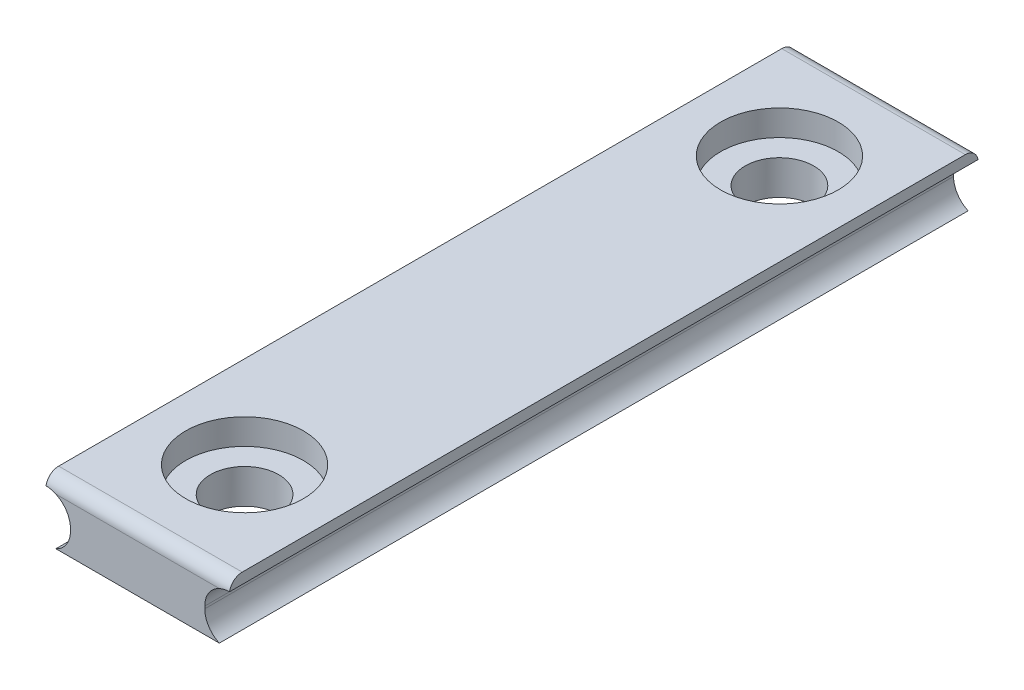
ISO-10303-21;
HEADER;
FILE_DESCRIPTION(('STEP AP214'),'2;1');
FILE_NAME('part.step','',(''),(''),'','','');
FILE_SCHEMA(('AUTOMOTIVE_DESIGN { 1 0 10303 214 1 1 1 1 }'));
ENDSEC;
DATA;
#1=APPLICATION_CONTEXT('core data for automotive mechanical design processes');
#2=APPLICATION_PROTOCOL_DEFINITION('international standard','automotive_design',2000,#1);
#3=PRODUCT_CONTEXT('',#1,'mechanical');
#4=PRODUCT('Part','Part','',(#3));
#5=PRODUCT_RELATED_PRODUCT_CATEGORY('part','',(#4));
#6=PRODUCT_DEFINITION_FORMATION('','',#4);
#7=PRODUCT_DEFINITION_CONTEXT('part definition',#1,'design');
#8=PRODUCT_DEFINITION('design','',#6,#7);
#9=PRODUCT_DEFINITION_SHAPE('','',#8);
#10=(LENGTH_UNIT() NAMED_UNIT(*) SI_UNIT(.MILLI.,.METRE.));
#11=(NAMED_UNIT(*) PLANE_ANGLE_UNIT() SI_UNIT($,.RADIAN.));
#12=(NAMED_UNIT(*) SI_UNIT($,.STERADIAN.) SOLID_ANGLE_UNIT());
#13=UNCERTAINTY_MEASURE_WITH_UNIT(LENGTH_MEASURE(1.E-05),#10,'distance_accuracy_value','');
#14=(GEOMETRIC_REPRESENTATION_CONTEXT(3) GLOBAL_UNCERTAINTY_ASSIGNED_CONTEXT((#13)) GLOBAL_UNIT_ASSIGNED_CONTEXT((#10,
#11,#12)) REPRESENTATION_CONTEXT('',''));
#15=CARTESIAN_POINT('',(0.,0.,0.));
#16=DIRECTION('',(0.,0.,1.));
#17=DIRECTION('',(1.,0.,0.));
#18=AXIS2_PLACEMENT_3D('',#15,#16,#17);
#19=CARTESIAN_POINT('',(0.,-1.705,12.5));
#20=DIRECTION('',(0.,1.,0.));
#21=DIRECTION('',(0.,0.,1.));
#22=AXIS2_PLACEMENT_3D('',#19,#20,#21);
#23=CYLINDRICAL_SURFACE('',#22,1.6);
#24=CARTESIAN_POINT('',(0.,0.505,12.5));
#25=DIRECTION('',(0.,1.,0.));
#26=DIRECTION('',(0.,0.,1.));
#27=AXIS2_PLACEMENT_3D('',#24,#25,#26);
#28=CIRCLE('',#27,1.6);
#29=CARTESIAN_POINT('',(0.,0.505,14.1));
#30=VERTEX_POINT('',#29);
#31=EDGE_CURVE('E198',#30,#30,#28,.T.);
#32=ORIENTED_EDGE('',*,*,#31,.T.);
#33=EDGE_LOOP('',(#32));
#34=FACE_BOUND('',#33,.T.);
#35=CARTESIAN_POINT('',(0.,-1.105,12.5));
#36=DIRECTION('',(0.,-1.,0.));
#37=DIRECTION('',(0.,0.,-1.));
#38=AXIS2_PLACEMENT_3D('',#35,#36,#37);
#39=CIRCLE('',#38,1.6);
#40=CARTESIAN_POINT('',(0.,-1.105,10.9));
#41=VERTEX_POINT('',#40);
#42=EDGE_CURVE('E312',#41,#41,#39,.T.);
#43=ORIENTED_EDGE('',*,*,#42,.T.);
#44=EDGE_LOOP('',(#43));
#45=FACE_BOUND('',#44,.T.);
#46=ADVANCED_FACE('F34',(#34,#45),#23,.F.);
#47=CARTESIAN_POINT('',(0.,-1.705,-12.5));
#48=DIRECTION('',(0.,1.,0.));
#49=DIRECTION('',(0.,0.,1.));
#50=AXIS2_PLACEMENT_3D('',#47,#48,#49);
#51=CYLINDRICAL_SURFACE('',#50,1.6);
#52=CARTESIAN_POINT('',(0.,0.505,-12.5));
#53=DIRECTION('',(0.,1.,0.));
#54=DIRECTION('',(0.,0.,1.));
#55=AXIS2_PLACEMENT_3D('',#52,#53,#54);
#56=CIRCLE('',#55,1.6);
#57=CARTESIAN_POINT('',(0.,0.505,-10.9));
#58=VERTEX_POINT('',#57);
#59=EDGE_CURVE('E163',#58,#58,#56,.F.);
#60=ORIENTED_EDGE('',*,*,#59,.F.);
#61=EDGE_LOOP('',(#60));
#62=FACE_BOUND('',#61,.T.);
#63=CARTESIAN_POINT('',(0.,-1.105,-12.5));
#64=DIRECTION('',(0.,-1.,0.));
#65=DIRECTION('',(0.,0.,-1.));
#66=AXIS2_PLACEMENT_3D('',#63,#64,#65);
#67=CIRCLE('',#66,1.6);
#68=CARTESIAN_POINT('',(0.,-1.105,-14.1));
#69=VERTEX_POINT('',#68);
#70=EDGE_CURVE('E317',#69,#69,#67,.F.);
#71=ORIENTED_EDGE('',*,*,#70,.F.);
#72=EDGE_LOOP('',(#71));
#73=FACE_BOUND('',#72,.T.);
#74=ADVANCED_FACE('F268',(#62,#73),#51,.F.);
#75=CARTESIAN_POINT('',(-4.29,-0.0549999999999999,17.5));
#76=DIRECTION('',(0.,0.,-1.));
#77=DIRECTION('',(-1.,0.,0.));
#78=AXIS2_PLACEMENT_3D('',#75,#76,#77);
#79=CYLINDRICAL_SURFACE('',#78,1.15);
#80=DIRECTION('',(0.,0.,-1.));
#81=VECTOR('',#80,1.);
#82=CARTESIAN_POINT('',(-3.82095842401766,-1.105,17.5));
#83=LINE('',#82,#81);
#84=CARTESIAN_POINT('',(-3.82095842401766,-1.105,17.5));
#85=VERTEX_POINT('',#84);
#86=CARTESIAN_POINT('',(-3.82095842401766,-1.105,-17.5));
#87=VERTEX_POINT('',#86);
#88=EDGE_CURVE('E136',#85,#87,#83,.T.);
#89=ORIENTED_EDGE('',*,*,#88,.F.);
#90=CARTESIAN_POINT('',(-4.29,-0.0549999999999999,17.5));
#91=DIRECTION('',(0.,0.,-1.));
#92=DIRECTION('',(-1.,0.,0.));
#93=AXIS2_PLACEMENT_3D('',#90,#91,#92);
#94=CIRCLE('',#93,1.15);
#95=CARTESIAN_POINT('',(-3.14,-0.0549999999999997,17.5));
#96=VERTEX_POINT('',#95);
#97=EDGE_CURVE('E144',#96,#85,#94,.T.);
#98=ORIENTED_EDGE('',*,*,#97,.F.);
#99=DIRECTION('',(0.,0.,-1.));
#100=VECTOR('',#99,1.);
#101=CARTESIAN_POINT('',(-3.14,-0.0549999999999997,17.5));
#102=LINE('',#101,#100);
#103=CARTESIAN_POINT('',(-3.14,-0.0549999999999997,-17.5));
#104=VERTEX_POINT('',#103);
#105=EDGE_CURVE('E186',#96,#104,#102,.T.);
#106=ORIENTED_EDGE('',*,*,#105,.T.);
#107=CARTESIAN_POINT('',(-4.29,-0.0549999999999999,-17.5));
#108=DIRECTION('',(0.,0.,-1.));
#109=DIRECTION('',(-1.,0.,0.));
#110=AXIS2_PLACEMENT_3D('',#107,#108,#109);
#111=CIRCLE('',#110,1.15);
#112=EDGE_CURVE('E165',#104,#87,#111,.T.);
#113=ORIENTED_EDGE('',*,*,#112,.T.);
#114=EDGE_LOOP('',(#89,#98,#106,#113));
#115=FACE_BOUND('',#114,.T.);
#116=ADVANCED_FACE('F266',(#115),#79,.F.);
#117=CARTESIAN_POINT('',(4.29,-0.0549999999999999,17.5));
#118=DIRECTION('',(0.,0.,-1.));
#119=DIRECTION('',(-1.,0.,0.));
#120=AXIS2_PLACEMENT_3D('',#117,#118,#119);
#121=CYLINDRICAL_SURFACE('',#120,1.15);
#122=DIRECTION('',(0.,0.,-1.));
#123=VECTOR('',#122,1.);
#124=CARTESIAN_POINT('',(3.82095842401766,-1.105,17.5));
#125=LINE('',#124,#123);
#126=CARTESIAN_POINT('',(3.82095842401766,-1.105,-17.5));
#127=VERTEX_POINT('',#126);
#128=CARTESIAN_POINT('',(3.82095842401766,-1.105,17.5));
#129=VERTEX_POINT('',#128);
#130=EDGE_CURVE('E125',#127,#129,#125,.F.);
#131=ORIENTED_EDGE('',*,*,#130,.F.);
#132=CARTESIAN_POINT('',(4.29,-0.0549999999999999,-17.5));
#133=DIRECTION('',(0.,0.,-1.));
#134=DIRECTION('',(1.,0.,0.));
#135=AXIS2_PLACEMENT_3D('',#132,#133,#134);
#136=CIRCLE('',#135,1.15);
#137=CARTESIAN_POINT('',(3.14,-0.0549999999999999,-17.5));
#138=VERTEX_POINT('',#137);
#139=EDGE_CURVE('E168',#127,#138,#136,.T.);
#140=ORIENTED_EDGE('',*,*,#139,.T.);
#141=DIRECTION('',(0.,0.,-1.));
#142=VECTOR('',#141,1.);
#143=CARTESIAN_POINT('',(3.14,-0.0549999999999999,17.5));
#144=LINE('',#143,#142);
#145=CARTESIAN_POINT('',(3.14,-0.0549999999999999,17.5));
#146=VERTEX_POINT('',#145);
#147=EDGE_CURVE('E148',#146,#138,#144,.T.);
#148=ORIENTED_EDGE('',*,*,#147,.F.);
#149=CARTESIAN_POINT('',(4.29,-0.0549999999999999,17.5));
#150=DIRECTION('',(0.,0.,-1.));
#151=DIRECTION('',(1.,0.,0.));
#152=AXIS2_PLACEMENT_3D('',#149,#150,#151);
#153=CIRCLE('',#152,1.15);
#154=EDGE_CURVE('E141',#129,#146,#153,.T.);
#155=ORIENTED_EDGE('',*,*,#154,.F.);
#156=EDGE_LOOP('',(#131,#140,#148,#155));
#157=FACE_BOUND('',#156,.T.);
#158=ADVANCED_FACE('F146',(#157),#121,.F.);
#159=CARTESIAN_POINT('',(-4.29,0.0550000000000001,17.5));
#160=DIRECTION('',(0.,0.,1.));
#161=DIRECTION('',(1.,0.,0.));
#162=AXIS2_PLACEMENT_3D('',#159,#160,#161);
#163=PLANE('',#162);
#164=CARTESIAN_POINT('',(4.29,0.0550000000000001,17.5));
#165=DIRECTION('',(0.,0.,-1.));
#166=DIRECTION('',(-1.,0.,0.));
#167=AXIS2_PLACEMENT_3D('',#164,#165,#166);
#168=CIRCLE('',#167,1.15);
#169=CARTESIAN_POINT('',(3.14,0.0550000000000001,17.5));
#170=VERTEX_POINT('',#169);
#171=CARTESIAN_POINT('',(3.82095842401766,1.105,17.5));
#172=VERTEX_POINT('',#171);
#173=EDGE_CURVE('E152',#170,#172,#168,.T.);
#174=ORIENTED_EDGE('',*,*,#173,.T.);
#175=DIRECTION('',(-1.,0.,0.));
#176=VECTOR('',#175,1.);
#177=CARTESIAN_POINT('',(-4.29,1.105,17.5));
#178=LINE('',#177,#176);
#179=CARTESIAN_POINT('',(-3.82095842401766,1.105,17.5));
#180=VERTEX_POINT('',#179);
#181=EDGE_CURVE('E11',#172,#180,#178,.T.);
#182=ORIENTED_EDGE('',*,*,#181,.T.);
#183=CARTESIAN_POINT('',(-4.29,0.0550000000000001,17.5));
#184=DIRECTION('',(0.,0.,-1.));
#185=DIRECTION('',(1.,0.,0.));
#186=AXIS2_PLACEMENT_3D('',#183,#184,#185);
#187=CIRCLE('',#186,1.15);
#188=CARTESIAN_POINT('',(-3.14,0.0550000000000001,17.5));
#189=VERTEX_POINT('',#188);
#190=EDGE_CURVE('E174',#180,#189,#187,.T.);
#191=ORIENTED_EDGE('',*,*,#190,.T.);
#192=DIRECTION('',(0.,-1.,0.));
#193=VECTOR('',#192,1.);
#194=CARTESIAN_POINT('',(-3.14,0.0550000000000001,17.5));
#195=LINE('',#194,#193);
#196=EDGE_CURVE('E154',#189,#96,#195,.T.);
#197=ORIENTED_EDGE('',*,*,#196,.T.);
#198=ORIENTED_EDGE('',*,*,#97,.T.);
#199=DIRECTION('',(-1.,0.,0.));
#200=VECTOR('',#199,1.);
#201=CARTESIAN_POINT('',(-4.29,-1.105,17.5));
#202=LINE('',#201,#200);
#203=EDGE_CURVE('E129',#129,#85,#202,.T.);
#204=ORIENTED_EDGE('',*,*,#203,.F.);
#205=ORIENTED_EDGE('',*,*,#154,.T.);
#206=DIRECTION('',(0.,1.,0.));
#207=VECTOR('',#206,1.);
#208=CARTESIAN_POINT('',(3.14,0.0550000000000001,17.5));
#209=LINE('',#208,#207);
#210=EDGE_CURVE('E150',#146,#170,#209,.T.);
#211=ORIENTED_EDGE('',*,*,#210,.T.);
#212=EDGE_LOOP('',(#174,#182,#191,#197,#198,#204,#205,#211));
#213=FACE_BOUND('',#212,.T.);
#214=ADVANCED_FACE('F140',(#213),#163,.T.);
#215=CARTESIAN_POINT('',(-4.29,0.0550000000000001,-17.5));
#216=DIRECTION('',(0.,0.,1.));
#217=DIRECTION('',(1.,0.,0.));
#218=AXIS2_PLACEMENT_3D('',#215,#216,#217);
#219=PLANE('',#218);
#220=CARTESIAN_POINT('',(-4.29,0.0550000000000001,-17.5));
#221=DIRECTION('',(0.,0.,-1.));
#222=DIRECTION('',(1.,0.,0.));
#223=AXIS2_PLACEMENT_3D('',#220,#221,#222);
#224=CIRCLE('',#223,1.15);
#225=CARTESIAN_POINT('',(-3.82095842401766,1.105,-17.5));
#226=VERTEX_POINT('',#225);
#227=CARTESIAN_POINT('',(-3.14,0.0550000000000001,-17.5));
#228=VERTEX_POINT('',#227);
#229=EDGE_CURVE('E160',#226,#228,#224,.T.);
#230=ORIENTED_EDGE('',*,*,#229,.F.);
#231=DIRECTION('',(-1.,0.,0.));
#232=VECTOR('',#231,1.);
#233=CARTESIAN_POINT('',(-4.29,1.105,-17.5));
#234=LINE('',#233,#232);
#235=CARTESIAN_POINT('',(3.82095842401766,1.105,-17.5));
#236=VERTEX_POINT('',#235);
#237=EDGE_CURVE('E465',#226,#236,#234,.F.);
#238=ORIENTED_EDGE('',*,*,#237,.T.);
#239=CARTESIAN_POINT('',(4.29,0.0550000000000001,-17.5));
#240=DIRECTION('',(0.,0.,-1.));
#241=DIRECTION('',(-1.,0.,0.));
#242=AXIS2_PLACEMENT_3D('',#239,#240,#241);
#243=CIRCLE('',#242,1.15);
#244=CARTESIAN_POINT('',(3.14,0.0550000000000001,-17.5));
#245=VERTEX_POINT('',#244);
#246=EDGE_CURVE('E172',#245,#236,#243,.T.);
#247=ORIENTED_EDGE('',*,*,#246,.F.);
#248=DIRECTION('',(0.,1.,0.));
#249=VECTOR('',#248,1.);
#250=CARTESIAN_POINT('',(3.14,0.0550000000000001,-17.5));
#251=LINE('',#250,#249);
#252=EDGE_CURVE('E170',#138,#245,#251,.T.);
#253=ORIENTED_EDGE('',*,*,#252,.F.);
#254=ORIENTED_EDGE('',*,*,#139,.F.);
#255=DIRECTION('',(1.,0.,0.));
#256=VECTOR('',#255,1.);
#257=CARTESIAN_POINT('',(-4.29,-1.105,-17.5));
#258=LINE('',#257,#256);
#259=EDGE_CURVE('E132',#87,#127,#258,.T.);
#260=ORIENTED_EDGE('',*,*,#259,.F.);
#261=ORIENTED_EDGE('',*,*,#112,.F.);
#262=DIRECTION('',(0.,-1.,0.));
#263=VECTOR('',#262,1.);
#264=CARTESIAN_POINT('',(-3.14,0.0550000000000001,-17.5));
#265=LINE('',#264,#263);
#266=EDGE_CURVE('E162',#228,#104,#265,.T.);
#267=ORIENTED_EDGE('',*,*,#266,.F.);
#268=EDGE_LOOP('',(#230,#238,#247,#253,#254,#260,#261,#267));
#269=FACE_BOUND('',#268,.T.);
#270=ADVANCED_FACE('F295',(#269),#219,.F.);
#271=CARTESIAN_POINT('',(-4.29,1.705,17.5));
#272=DIRECTION('',(0.,-1.,0.));
#273=DIRECTION('',(0.,0.,-1.));
#274=AXIS2_PLACEMENT_3D('',#271,#272,#273);
#275=PLANE('',#274);
#276=CARTESIAN_POINT('',(0.,1.705,-12.5));
#277=DIRECTION('',(0.,1.,0.));
#278=DIRECTION('',(0.,0.,1.));
#279=AXIS2_PLACEMENT_3D('',#276,#277,#278);
#280=CIRCLE('',#279,2.75);
#281=CARTESIAN_POINT('',(0.,1.705,-9.75));
#282=VERTEX_POINT('',#281);
#283=EDGE_CURVE('E201',#282,#282,#280,.T.);
#284=ORIENTED_EDGE('',*,*,#283,.F.);
#285=EDGE_LOOP('',(#284));
#286=FACE_BOUND('',#285,.T.);
#287=DIRECTION('',(0.,0.,-1.));
#288=VECTOR('',#287,1.);
#289=CARTESIAN_POINT('',(4.29,1.705,17.5));
#290=LINE('',#289,#288);
#291=CARTESIAN_POINT('',(4.29,1.705,16.9));
#292=VERTEX_POINT('',#291);
#293=CARTESIAN_POINT('',(4.29,1.705,-16.9));
#294=VERTEX_POINT('',#293);
#295=EDGE_CURVE('E177',#292,#294,#290,.T.);
#296=ORIENTED_EDGE('',*,*,#295,.T.);
#297=DIRECTION('',(-1.,0.,0.));
#298=VECTOR('',#297,1.);
#299=CARTESIAN_POINT('',(-4.29,1.705,-16.9));
#300=LINE('',#299,#298);
#301=CARTESIAN_POINT('',(-4.29,1.705,-16.9));
#302=VERTEX_POINT('',#301);
#303=EDGE_CURVE('E206',#294,#302,#300,.T.);
#304=ORIENTED_EDGE('',*,*,#303,.T.);
#305=DIRECTION('',(0.,0.,-1.));
#306=VECTOR('',#305,1.);
#307=CARTESIAN_POINT('',(-4.29,1.705,17.5));
#308=LINE('',#307,#306);
#309=CARTESIAN_POINT('',(-4.29,1.705,16.9));
#310=VERTEX_POINT('',#309);
#311=EDGE_CURVE('E159',#310,#302,#308,.T.);
#312=ORIENTED_EDGE('',*,*,#311,.F.);
#313=DIRECTION('',(-1.,0.,0.));
#314=VECTOR('',#313,1.);
#315=CARTESIAN_POINT('',(4.29,1.705,16.9));
#316=LINE('',#315,#314);
#317=EDGE_CURVE('E204',#310,#292,#316,.F.);
#318=ORIENTED_EDGE('',*,*,#317,.T.);
#319=EDGE_LOOP('',(#296,#304,#312,#318));
#320=FACE_BOUND('',#319,.T.);
#321=CARTESIAN_POINT('',(0.,1.705,12.5));
#322=DIRECTION('',(0.,-1.,0.));
#323=DIRECTION('',(0.,0.,-1.));
#324=AXIS2_PLACEMENT_3D('',#321,#322,#323);
#325=CIRCLE('',#324,2.75);
#326=CARTESIAN_POINT('',(0.,1.705,9.75));
#327=VERTEX_POINT('',#326);
#328=EDGE_CURVE('E310',#327,#327,#325,.T.);
#329=ORIENTED_EDGE('',*,*,#328,.T.);
#330=EDGE_LOOP('',(#329));
#331=FACE_BOUND('',#330,.T.);
#332=ADVANCED_FACE('F235',(#286,#320,#331),#275,.F.);
#333=CARTESIAN_POINT('',(-4.29,1.705,17.5));
#334=DIRECTION('',(1.,0.,0.));
#335=DIRECTION('',(0.,1.,0.));
#336=AXIS2_PLACEMENT_3D('',#333,#334,#335);
#337=PLANE('',#336);
#338=ORIENTED_EDGE('',*,*,#311,.T.);
#339=CARTESIAN_POINT('',(-4.29,1.105,-16.9));
#340=DIRECTION('',(1.,0.,0.));
#341=DIRECTION('',(0.,1.,0.));
#342=AXIS2_PLACEMENT_3D('',#339,#340,#341);
#343=CIRCLE('',#342,0.6);
#344=CARTESIAN_POINT('',(-4.29,1.205,-17.49160797831));
#345=VERTEX_POINT('',#344);
#346=EDGE_CURVE('E211',#302,#345,#343,.F.);
#347=ORIENTED_EDGE('',*,*,#346,.T.);
#348=DIRECTION('',(0.,0.,-1.));
#349=VECTOR('',#348,1.);
#350=CARTESIAN_POINT('',(-4.29,1.205,17.5));
#351=LINE('',#350,#349);
#352=CARTESIAN_POINT('',(-4.29,1.205,17.49160797831));
#353=VERTEX_POINT('',#352);
#354=EDGE_CURVE('E192',#353,#345,#351,.T.);
#355=ORIENTED_EDGE('',*,*,#354,.F.);
#356=CARTESIAN_POINT('',(-4.29,1.105,16.9));
#357=DIRECTION('',(1.,0.,0.));
#358=DIRECTION('',(0.,1.,0.));
#359=AXIS2_PLACEMENT_3D('',#356,#357,#358);
#360=CIRCLE('',#359,0.6);
#361=EDGE_CURVE('E209',#353,#310,#360,.F.);
#362=ORIENTED_EDGE('',*,*,#361,.T.);
#363=EDGE_LOOP('',(#338,#347,#355,#362));
#364=FACE_BOUND('',#363,.T.);
#365=ADVANCED_FACE('F230',(#364),#337,.F.);
#366=CARTESIAN_POINT('',(-4.29,0.0550000000000001,17.5));
#367=DIRECTION('',(0.,0.,-1.));
#368=DIRECTION('',(-1.,0.,0.));
#369=AXIS2_PLACEMENT_3D('',#366,#367,#368);
#370=CYLINDRICAL_SURFACE('',#369,1.15);
#371=ORIENTED_EDGE('',*,*,#354,.T.);
#372=CARTESIAN_POINT('',(-4.29,1.205,-17.49160797831));
#373=CARTESIAN_POINT('',(-4.25756156904964,1.20500380288565,-17.491586887768));
#374=CARTESIAN_POINT('',(-4.22512492160803,1.20362771507594,-17.4918393715753));
#375=CARTESIAN_POINT('',(-4.16047417559409,1.19814196948043,-17.4927383564858));
#376=CARTESIAN_POINT('',(-4.12826018224165,1.19403109811136,-17.4933850325044));
#377=CARTESIAN_POINT('',(-4.06485662902626,1.18319665472955,-17.4949057370647));
#378=CARTESIAN_POINT('',(-4.03365898906297,1.17651955147944,-17.4957756353561));
#379=CARTESIAN_POINT('',(-3.97194104736339,1.16060071536173,-17.4974722173912));
#380=CARTESIAN_POINT('',(-3.94142031536342,1.15136066515768,-17.4982989290666));
#381=CARTESIAN_POINT('',(-3.89606605891533,1.13554518059803,-17.4992455321827));
#382=CARTESIAN_POINT('',(-3.8809066443118,1.12989734062912,-17.4995130304239));
#383=CARTESIAN_POINT('',(-3.85077083216336,1.11794009492797,-17.499890291241));
#384=CARTESIAN_POINT('',(-3.83579555199966,1.11162785176349,-17.4999993452061));
#385=CARTESIAN_POINT('',(-3.82095842401766,1.105,-17.5));
#386=B_SPLINE_CURVE_WITH_KNOTS('',3,(#372,#373,#374,#375,#376,#377,#378,#379,#380,#381,#382,
#383,#384,#385),.UNSPECIFIED.,.F.,.F.,(4,2,2,2,2,2,4),(0.,0.0972827109880876,0.194608620821747,
0.290249425299556,0.385827586295471,0.434353023317055,0.483094819757586),.UNSPECIFIED.);
#387=EDGE_CURVE('E219',#345,#226,#386,.T.);
#388=ORIENTED_EDGE('',*,*,#387,.T.);
#389=ORIENTED_EDGE('',*,*,#229,.T.);
#390=DIRECTION('',(0.,0.,-1.));
#391=VECTOR('',#390,1.);
#392=CARTESIAN_POINT('',(-3.14,0.0550000000000001,17.5));
#393=LINE('',#392,#391);
#394=EDGE_CURVE('E189',#189,#228,#393,.T.);
#395=ORIENTED_EDGE('',*,*,#394,.F.);
#396=ORIENTED_EDGE('',*,*,#190,.F.);
#397=CARTESIAN_POINT('',(-3.82095842401766,1.105,17.5));
#398=CARTESIAN_POINT('',(-3.85056177866166,1.11822767067681,17.4999848940376));
#399=CARTESIAN_POINT('',(-3.88072120304169,1.13019471704777,17.4995620740827));
#400=CARTESIAN_POINT('',(-3.9419513471989,1.15154539905641,17.4982915754182));
#401=CARTESIAN_POINT('',(-3.97302254327143,1.1609276568676,17.4974436707928));
#402=CARTESIAN_POINT('',(-4.03529716255089,1.17689233999088,17.4957294569942));
#403=CARTESIAN_POINT('',(-4.06648888866436,1.18352061985109,17.4948637243464));
#404=CARTESIAN_POINT('',(-4.12930377099602,1.19416205655957,17.493362904065));
#405=CARTESIAN_POINT('',(-4.16092661820888,1.19817699527914,17.4927276594073));
#406=CARTESIAN_POINT('',(-4.20880599584271,1.20224472650108,17.4920684955407));
#407=CARTESIAN_POINT('',(-4.22498295327944,1.2032750082971,17.4918975615656));
#408=CARTESIAN_POINT('',(-4.25743917888252,1.204654182176,17.4916665623711));
#409=CARTESIAN_POINT('',(-4.27371858099357,1.20500000534953,17.4916069965592));
#410=CARTESIAN_POINT('',(-4.29,1.205,17.49160797831));
#411=B_SPLINE_CURVE_WITH_KNOTS('',3,(#397,#398,#399,#400,#401,#402,#403,#404,#405,#406,#407,
#408,#409,#410),.UNSPECIFIED.,.F.,.F.,(4,2,2,2,2,2,4),(0.,0.0972331892838668,0.194518109059577,
0.290111135163632,0.385638913990428,0.434257883842449,0.483094357292528),.UNSPECIFIED.);
#412=EDGE_CURVE('E213',#180,#353,#411,.T.);
#413=ORIENTED_EDGE('',*,*,#412,.T.);
#414=EDGE_LOOP('',(#371,#388,#389,#395,#396,#413));
#415=FACE_BOUND('',#414,.T.);
#416=ADVANCED_FACE('F224',(#415),#370,.F.);
#417=CARTESIAN_POINT('',(-3.14,0.0550000000000001,17.5));
#418=DIRECTION('',(1.,0.,0.));
#419=DIRECTION('',(0.,0.,-1.));
#420=AXIS2_PLACEMENT_3D('',#417,#418,#419);
#421=PLANE('',#420);
#422=ORIENTED_EDGE('',*,*,#266,.T.);
#423=ORIENTED_EDGE('',*,*,#105,.F.);
#424=ORIENTED_EDGE('',*,*,#196,.F.);
#425=ORIENTED_EDGE('',*,*,#394,.T.);
#426=EDGE_LOOP('',(#422,#423,#424,#425));
#427=FACE_BOUND('',#426,.T.);
#428=ADVANCED_FACE('F229',(#427),#421,.F.);
#429=CARTESIAN_POINT('',(3.14,0.0550000000000001,17.5));
#430=DIRECTION('',(-1.,0.,0.));
#431=DIRECTION('',(0.,0.,1.));
#432=AXIS2_PLACEMENT_3D('',#429,#430,#431);
#433=PLANE('',#432);
#434=ORIENTED_EDGE('',*,*,#252,.T.);
#435=DIRECTION('',(0.,0.,-1.));
#436=VECTOR('',#435,1.);
#437=CARTESIAN_POINT('',(3.14,0.0550000000000001,17.5));
#438=LINE('',#437,#436);
#439=EDGE_CURVE('E182',#170,#245,#438,.T.);
#440=ORIENTED_EDGE('',*,*,#439,.F.);
#441=ORIENTED_EDGE('',*,*,#210,.F.);
#442=ORIENTED_EDGE('',*,*,#147,.T.);
#443=EDGE_LOOP('',(#434,#440,#441,#442));
#444=FACE_BOUND('',#443,.T.);
#445=ADVANCED_FACE('F259',(#444),#433,.F.);
#446=CARTESIAN_POINT('',(4.29,0.0550000000000001,17.5));
#447=DIRECTION('',(0.,0.,-1.));
#448=DIRECTION('',(-1.,0.,0.));
#449=AXIS2_PLACEMENT_3D('',#446,#447,#448);
#450=CYLINDRICAL_SURFACE('',#449,1.15);
#451=ORIENTED_EDGE('',*,*,#246,.T.);
#452=CARTESIAN_POINT('',(3.82095842401766,1.105,-17.5));
#453=CARTESIAN_POINT('',(3.85056177866166,1.11822767067681,-17.4999848940376));
#454=CARTESIAN_POINT('',(3.88072120304169,1.13019471704777,-17.4995620740827));
#455=CARTESIAN_POINT('',(3.9419513471989,1.15154539905641,-17.4982915754182));
#456=CARTESIAN_POINT('',(3.97302254327143,1.1609276568676,-17.4974436707928));
#457=CARTESIAN_POINT('',(4.03529716255089,1.17689233999088,-17.4957294569942));
#458=CARTESIAN_POINT('',(4.06648888866436,1.18352061985109,-17.4948637243464));
#459=CARTESIAN_POINT('',(4.12930377099602,1.19416205655957,-17.493362904065));
#460=CARTESIAN_POINT('',(4.16092661820888,1.19817699527914,-17.4927276594073));
#461=CARTESIAN_POINT('',(4.20880599584271,1.20224472650108,-17.4920684955407));
#462=CARTESIAN_POINT('',(4.22498295327944,1.2032750082971,-17.4918975615656));
#463=CARTESIAN_POINT('',(4.25743917888252,1.204654182176,-17.4916665623711));
#464=CARTESIAN_POINT('',(4.27371858099357,1.20500000534953,-17.4916069965592));
#465=CARTESIAN_POINT('',(4.29,1.205,-17.49160797831));
#466=B_SPLINE_CURVE_WITH_KNOTS('',3,(#452,#453,#454,#455,#456,#457,#458,#459,#460,#461,#462,
#463,#464,#465),.UNSPECIFIED.,.F.,.F.,(4,2,2,2,2,2,4),(0.,0.0972331892838651,0.194518109059576,
0.29011113516363,0.385638913990424,0.434257883842447,0.483094357292528),.UNSPECIFIED.);
#467=CARTESIAN_POINT('',(4.29,1.205,-17.49160797831));
#468=VERTEX_POINT('',#467);
#469=EDGE_CURVE('E56',#236,#468,#466,.T.);
#470=ORIENTED_EDGE('',*,*,#469,.T.);
#471=DIRECTION('',(0.,0.,-1.));
#472=VECTOR('',#471,1.);
#473=CARTESIAN_POINT('',(4.29,1.205,17.5));
#474=LINE('',#473,#472);
#475=CARTESIAN_POINT('',(4.29,1.205,17.49160797831));
#476=VERTEX_POINT('',#475);
#477=EDGE_CURVE('E180',#476,#468,#474,.T.);
#478=ORIENTED_EDGE('',*,*,#477,.F.);
#479=CARTESIAN_POINT('',(4.29,1.205,17.49160797831));
#480=CARTESIAN_POINT('',(4.25756156904964,1.20500380288565,17.491586887768));
#481=CARTESIAN_POINT('',(4.22512492160803,1.20362771507594,17.4918393715753));
#482=CARTESIAN_POINT('',(4.16047417559409,1.19814196948043,17.4927383564858));
#483=CARTESIAN_POINT('',(4.12826018224165,1.19403109811136,17.4933850325044));
#484=CARTESIAN_POINT('',(4.06485662902626,1.18319665472955,17.4949057370647));
#485=CARTESIAN_POINT('',(4.03365898906297,1.17651955147944,17.4957756353561));
#486=CARTESIAN_POINT('',(3.97194104736339,1.16060071536173,17.4974722173912));
#487=CARTESIAN_POINT('',(3.94142031536342,1.15136066515768,17.4982989290666));
#488=CARTESIAN_POINT('',(3.89606605891533,1.13554518059803,17.4992455321827));
#489=CARTESIAN_POINT('',(3.88090664431179,1.12989734062912,17.4995130304239));
#490=CARTESIAN_POINT('',(3.85077083216336,1.11794009492797,17.499890291241));
#491=CARTESIAN_POINT('',(3.83579555199966,1.11162785176349,17.4999993452061));
#492=CARTESIAN_POINT('',(3.82095842401766,1.105,17.5));
#493=B_SPLINE_CURVE_WITH_KNOTS('',3,(#479,#480,#481,#482,#483,#484,#485,#486,#487,#488,#489,
#490,#491,#492),.UNSPECIFIED.,.F.,.F.,(4,2,2,2,2,2,4),(0.,0.0972827109880876,0.194608620821747,
0.290249425299558,0.385827586295471,0.434353023317055,0.483094819757585),.UNSPECIFIED.);
#494=EDGE_CURVE('E50',#476,#172,#493,.T.);
#495=ORIENTED_EDGE('',*,*,#494,.T.);
#496=ORIENTED_EDGE('',*,*,#173,.F.);
#497=ORIENTED_EDGE('',*,*,#439,.T.);
#498=EDGE_LOOP('',(#451,#470,#478,#495,#496,#497));
#499=FACE_BOUND('',#498,.T.);
#500=ADVANCED_FACE('F253',(#499),#450,.F.);
#501=CARTESIAN_POINT('',(4.29,1.705,17.5));
#502=DIRECTION('',(-1.,0.,0.));
#503=DIRECTION('',(0.,-1.,0.));
#504=AXIS2_PLACEMENT_3D('',#501,#502,#503);
#505=PLANE('',#504);
#506=ORIENTED_EDGE('',*,*,#477,.T.);
#507=CARTESIAN_POINT('',(4.29,1.105,-16.9));
#508=DIRECTION('',(-1.,0.,0.));
#509=DIRECTION('',(0.,-1.,0.));
#510=AXIS2_PLACEMENT_3D('',#507,#508,#509);
#511=CIRCLE('',#510,0.6);
#512=EDGE_CURVE('E43',#468,#294,#511,.F.);
#513=ORIENTED_EDGE('',*,*,#512,.T.);
#514=ORIENTED_EDGE('',*,*,#295,.F.);
#515=CARTESIAN_POINT('',(4.29,1.105,16.9));
#516=DIRECTION('',(-1.,0.,0.));
#517=DIRECTION('',(0.,-1.,0.));
#518=AXIS2_PLACEMENT_3D('',#515,#516,#517);
#519=CIRCLE('',#518,0.6);
#520=EDGE_CURVE('E249',#292,#476,#519,.F.);
#521=ORIENTED_EDGE('',*,*,#520,.T.);
#522=EDGE_LOOP('',(#506,#513,#514,#521));
#523=FACE_BOUND('',#522,.T.);
#524=ADVANCED_FACE('F258',(#523),#505,.F.);
#525=CARTESIAN_POINT('',(0.,0.505,-12.5));
#526=DIRECTION('',(0.,1.,0.));
#527=DIRECTION('',(0.,0.,1.));
#528=AXIS2_PLACEMENT_3D('',#525,#526,#527);
#529=PLANE('',#528);
#530=CARTESIAN_POINT('',(0.,0.505,-12.5));
#531=DIRECTION('',(0.,1.,0.));
#532=DIRECTION('',(0.,0.,1.));
#533=AXIS2_PLACEMENT_3D('',#530,#531,#532);
#534=CIRCLE('',#533,2.75);
#535=CARTESIAN_POINT('',(0.,0.505,-9.75));
#536=VERTEX_POINT('',#535);
#537=EDGE_CURVE('E197',#536,#536,#534,.T.);
#538=ORIENTED_EDGE('',*,*,#537,.T.);
#539=EDGE_LOOP('',(#538));
#540=FACE_BOUND('',#539,.T.);
#541=ORIENTED_EDGE('',*,*,#59,.T.);
#542=EDGE_LOOP('',(#541));
#543=FACE_BOUND('',#542,.T.);
#544=ADVANCED_FACE('F285',(#540,#543),#529,.T.);
#545=CARTESIAN_POINT('',(0.,0.505,-12.5));
#546=DIRECTION('',(0.,1.,0.));
#547=DIRECTION('',(0.,0.,1.));
#548=AXIS2_PLACEMENT_3D('',#545,#546,#547);
#549=CYLINDRICAL_SURFACE('',#548,2.75);
#550=ORIENTED_EDGE('',*,*,#537,.F.);
#551=EDGE_LOOP('',(#550));
#552=FACE_BOUND('',#551,.T.);
#553=ORIENTED_EDGE('',*,*,#283,.T.);
#554=EDGE_LOOP('',(#553));
#555=FACE_BOUND('',#554,.T.);
#556=ADVANCED_FACE('F288',(#552,#555),#549,.F.);
#557=CARTESIAN_POINT('',(0.,0.505,12.5));
#558=DIRECTION('',(0.,1.,0.));
#559=DIRECTION('',(0.,0.,1.));
#560=AXIS2_PLACEMENT_3D('',#557,#558,#559);
#561=CYLINDRICAL_SURFACE('',#560,2.75);
#562=CARTESIAN_POINT('',(0.,0.505,12.5));
#563=DIRECTION('',(0.,-1.,0.));
#564=DIRECTION('',(0.,0.,-1.));
#565=AXIS2_PLACEMENT_3D('',#562,#563,#564);
#566=CIRCLE('',#565,2.75);
#567=CARTESIAN_POINT('',(0.,0.505,9.75));
#568=VERTEX_POINT('',#567);
#569=EDGE_CURVE('E202',#568,#568,#566,.T.);
#570=ORIENTED_EDGE('',*,*,#569,.T.);
#571=EDGE_LOOP('',(#570));
#572=FACE_BOUND('',#571,.T.);
#573=ORIENTED_EDGE('',*,*,#328,.F.);
#574=EDGE_LOOP('',(#573));
#575=FACE_BOUND('',#574,.T.);
#576=ADVANCED_FACE('F283',(#572,#575),#561,.F.);
#577=CARTESIAN_POINT('',(0.,0.505,12.5));
#578=DIRECTION('',(0.,1.,0.));
#579=DIRECTION('',(0.,0.,-1.));
#580=AXIS2_PLACEMENT_3D('',#577,#578,#579);
#581=PLANE('',#580);
#582=ORIENTED_EDGE('',*,*,#31,.F.);
#583=EDGE_LOOP('',(#582));
#584=FACE_BOUND('',#583,.T.);
#585=ORIENTED_EDGE('',*,*,#569,.F.);
#586=EDGE_LOOP('',(#585));
#587=FACE_BOUND('',#586,.T.);
#588=ADVANCED_FACE('F336',(#584,#587),#581,.T.);
#589=CARTESIAN_POINT('',(0.,-1.105,0.));
#590=DIRECTION('',(0.,-1.,0.));
#591=DIRECTION('',(0.,0.,-1.));
#592=AXIS2_PLACEMENT_3D('',#589,#590,#591);
#593=PLANE('',#592);
#594=ORIENTED_EDGE('',*,*,#42,.F.);
#595=EDGE_LOOP('',(#594));
#596=FACE_BOUND('',#595,.T.);
#597=ORIENTED_EDGE('',*,*,#88,.T.);
#598=ORIENTED_EDGE('',*,*,#259,.T.);
#599=ORIENTED_EDGE('',*,*,#130,.T.);
#600=ORIENTED_EDGE('',*,*,#203,.T.);
#601=EDGE_LOOP('',(#597,#598,#599,#600));
#602=FACE_BOUND('',#601,.T.);
#603=ORIENTED_EDGE('',*,*,#70,.T.);
#604=EDGE_LOOP('',(#603));
#605=FACE_BOUND('',#604,.T.);
#606=ADVANCED_FACE('F127',(#596,#602,#605),#593,.T.);
#607=CARTESIAN_POINT('',(-4.29,1.105,-16.9));
#608=DIRECTION('',(-1.,0.,0.));
#609=DIRECTION('',(0.,0.,1.));
#610=AXIS2_PLACEMENT_3D('',#607,#608,#609);
#611=CYLINDRICAL_SURFACE('',#610,0.6);
#612=ORIENTED_EDGE('',*,*,#469,.F.);
#613=ORIENTED_EDGE('',*,*,#237,.F.);
#614=ORIENTED_EDGE('',*,*,#387,.F.);
#615=ORIENTED_EDGE('',*,*,#346,.F.);
#616=ORIENTED_EDGE('',*,*,#303,.F.);
#617=ORIENTED_EDGE('',*,*,#512,.F.);
#618=EDGE_LOOP('',(#612,#613,#614,#615,#616,#617));
#619=FACE_BOUND('',#618,.T.);
#620=ADVANCED_FACE('F237',(#619),#611,.T.);
#621=CARTESIAN_POINT('',(-4.29,1.105,16.9));
#622=DIRECTION('',(1.,0.,0.));
#623=DIRECTION('',(0.,0.,-1.));
#624=AXIS2_PLACEMENT_3D('',#621,#622,#623);
#625=CYLINDRICAL_SURFACE('',#624,0.6);
#626=ORIENTED_EDGE('',*,*,#520,.F.);
#627=ORIENTED_EDGE('',*,*,#317,.F.);
#628=ORIENTED_EDGE('',*,*,#361,.F.);
#629=ORIENTED_EDGE('',*,*,#412,.F.);
#630=ORIENTED_EDGE('',*,*,#181,.F.);
#631=ORIENTED_EDGE('',*,*,#494,.F.);
#632=EDGE_LOOP('',(#626,#627,#628,#629,#630,#631));
#633=FACE_BOUND('',#632,.T.);
#634=ADVANCED_FACE('F36',(#633),#625,.T.);
#635=CLOSED_SHELL('',(#46,#74,#116,#158,#214,#270,#332,#365,#416,#428,#445,#500,#524,#544,#556,
#576,#588,#606,#620,#634));
#636=MANIFOLD_SOLID_BREP('B2',#635);
#637=ADVANCED_BREP_SHAPE_REPRESENTATION('',(#18,#636),#14);
#638=SHAPE_DEFINITION_REPRESENTATION(#9,#637);
ENDSEC;
END-ISO-10303-21;
